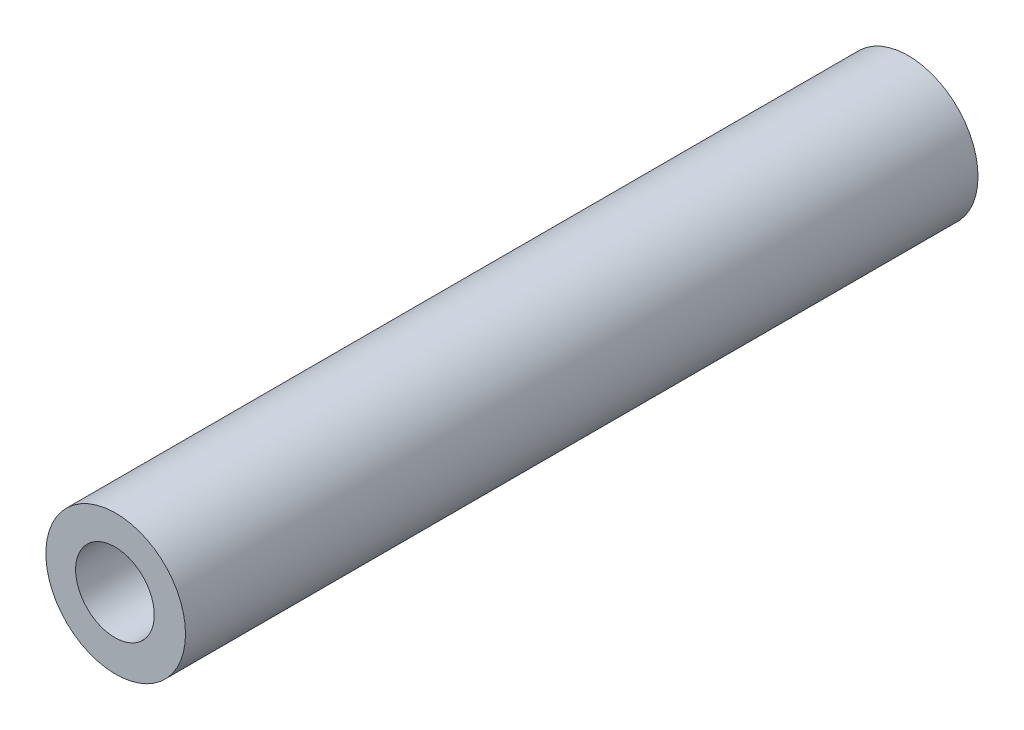
ISO-10303-21;
HEADER;
FILE_DESCRIPTION(('STEP AP214'),'2;1');
FILE_NAME('part.step','',(''),(''),'','','');
FILE_SCHEMA(('AUTOMOTIVE_DESIGN { 1 0 10303 214 1 1 1 1 }'));
ENDSEC;
DATA;
#1=APPLICATION_CONTEXT('core data for automotive mechanical design processes');
#2=APPLICATION_PROTOCOL_DEFINITION('international standard','automotive_design',2000,#1);
#3=PRODUCT_CONTEXT('',#1,'mechanical');
#4=PRODUCT('Part','Part','',(#3));
#5=PRODUCT_RELATED_PRODUCT_CATEGORY('part','',(#4));
#6=PRODUCT_DEFINITION_FORMATION('','',#4);
#7=PRODUCT_DEFINITION_CONTEXT('part definition',#1,'design');
#8=PRODUCT_DEFINITION('design','',#6,#7);
#9=PRODUCT_DEFINITION_SHAPE('','',#8);
#10=(LENGTH_UNIT() NAMED_UNIT(*) SI_UNIT(.MILLI.,.METRE.));
#11=(NAMED_UNIT(*) PLANE_ANGLE_UNIT() SI_UNIT($,.RADIAN.));
#12=(NAMED_UNIT(*) SI_UNIT($,.STERADIAN.) SOLID_ANGLE_UNIT());
#13=UNCERTAINTY_MEASURE_WITH_UNIT(LENGTH_MEASURE(1.E-05),#10,'distance_accuracy_value','');
#14=(GEOMETRIC_REPRESENTATION_CONTEXT(3) GLOBAL_UNCERTAINTY_ASSIGNED_CONTEXT((#13)) GLOBAL_UNIT_ASSIGNED_CONTEXT((#10,
#11,#12)) REPRESENTATION_CONTEXT('',''));
#15=CARTESIAN_POINT('',(0.,0.,0.));
#16=DIRECTION('',(0.,0.,1.));
#17=DIRECTION('',(1.,0.,0.));
#18=AXIS2_PLACEMENT_3D('',#15,#16,#17);
#19=CARTESIAN_POINT('',(0.0464583442311435,-0.0649309557246265,66.));
#20=DIRECTION('',(0.,0.,-1.));
#21=DIRECTION('',(-1.,0.,0.));
#22=AXIS2_PLACEMENT_3D('',#19,#20,#21);
#23=CYLINDRICAL_SURFACE('',#22,5.815);
#24=CARTESIAN_POINT('',(0.0464583442311435,-0.0649309557246265,66.));
#25=DIRECTION('',(0.,0.,1.));
#26=DIRECTION('',(1.,0.,0.));
#27=AXIS2_PLACEMENT_3D('',#24,#25,#26);
#28=CIRCLE('',#27,5.815);
#29=CARTESIAN_POINT('',(5.86145834423114,-0.0649309557246265,66.));
#30=VERTEX_POINT('',#29);
#31=EDGE_CURVE('E10',#30,#30,#28,.T.);
#32=ORIENTED_EDGE('',*,*,#31,.F.);
#33=EDGE_LOOP('',(#32));
#34=FACE_BOUND('',#33,.T.);
#35=CARTESIAN_POINT('',(0.0464583442311435,-0.0649309557246265,0.));
#36=DIRECTION('',(0.,0.,1.));
#37=DIRECTION('',(1.,0.,0.));
#38=AXIS2_PLACEMENT_3D('',#35,#36,#37);
#39=CIRCLE('',#38,5.815);
#40=CARTESIAN_POINT('',(5.86145834423114,-0.0649309557246265,0.));
#41=VERTEX_POINT('',#40);
#42=EDGE_CURVE('E40',#41,#41,#39,.T.);
#43=ORIENTED_EDGE('',*,*,#42,.T.);
#44=EDGE_LOOP('',(#43));
#45=FACE_BOUND('',#44,.T.);
#46=ADVANCED_FACE('F37',(#34,#45),#23,.T.);
#47=CARTESIAN_POINT('',(0.0464583442311435,-0.0649309557246265,66.));
#48=DIRECTION('',(0.,0.,1.));
#49=DIRECTION('',(1.,0.,0.));
#50=AXIS2_PLACEMENT_3D('',#47,#48,#49);
#51=PLANE('',#50);
#52=CARTESIAN_POINT('',(-0.0169230198664022,0.00637307888514826,66.));
#53=DIRECTION('',(0.,0.,1.));
#54=DIRECTION('',(1.,0.,0.));
#55=AXIS2_PLACEMENT_3D('',#52,#53,#54);
#56=CIRCLE('',#55,3.275);
#57=CARTESIAN_POINT('',(3.2580769801336,0.00637307888514826,66.));
#58=VERTEX_POINT('',#57);
#59=EDGE_CURVE('E51',#58,#58,#56,.T.);
#60=ORIENTED_EDGE('',*,*,#59,.F.);
#61=EDGE_LOOP('',(#60));
#62=FACE_BOUND('',#61,.T.);
#63=ORIENTED_EDGE('',*,*,#31,.T.);
#64=EDGE_LOOP('',(#63));
#65=FACE_BOUND('',#64,.T.);
#66=ADVANCED_FACE('F68',(#62,#65),#51,.T.);
#67=CARTESIAN_POINT('',(0.0464583442311435,-0.0649309557246265,0.));
#68=DIRECTION('',(0.,0.,1.));
#69=DIRECTION('',(1.,0.,0.));
#70=AXIS2_PLACEMENT_3D('',#67,#68,#69);
#71=PLANE('',#70);
#72=CARTESIAN_POINT('',(-0.0169230198664022,0.00637307888514826,0.));
#73=DIRECTION('',(0.,0.,1.));
#74=DIRECTION('',(1.,0.,0.));
#75=AXIS2_PLACEMENT_3D('',#72,#73,#74);
#76=CIRCLE('',#75,3.275);
#77=CARTESIAN_POINT('',(3.2580769801336,0.00637307888514826,0.));
#78=VERTEX_POINT('',#77);
#79=EDGE_CURVE('E49',#78,#78,#76,.T.);
#80=ORIENTED_EDGE('',*,*,#79,.T.);
#81=EDGE_LOOP('',(#80));
#82=FACE_BOUND('',#81,.T.);
#83=ORIENTED_EDGE('',*,*,#42,.F.);
#84=EDGE_LOOP('',(#83));
#85=FACE_BOUND('',#84,.T.);
#86=ADVANCED_FACE('F59',(#82,#85),#71,.F.);
#87=CARTESIAN_POINT('',(-0.0169230198664022,0.00637307888514826,0.));
#88=DIRECTION('',(0.,0.,1.));
#89=DIRECTION('',(1.,0.,0.));
#90=AXIS2_PLACEMENT_3D('',#87,#88,#89);
#91=CYLINDRICAL_SURFACE('',#90,3.275);
#92=ORIENTED_EDGE('',*,*,#79,.F.);
#93=EDGE_LOOP('',(#92));
#94=FACE_BOUND('',#93,.T.);
#95=ORIENTED_EDGE('',*,*,#59,.T.);
#96=EDGE_LOOP('',(#95));
#97=FACE_BOUND('',#96,.T.);
#98=ADVANCED_FACE('F62',(#94,#97),#91,.F.);
#99=CLOSED_SHELL('',(#46,#66,#86,#98));
#100=MANIFOLD_SOLID_BREP('B2',#99);
#101=ADVANCED_BREP_SHAPE_REPRESENTATION('',(#18,#100),#14);
#102=SHAPE_DEFINITION_REPRESENTATION(#9,#101);
ENDSEC;
END-ISO-10303-21;
